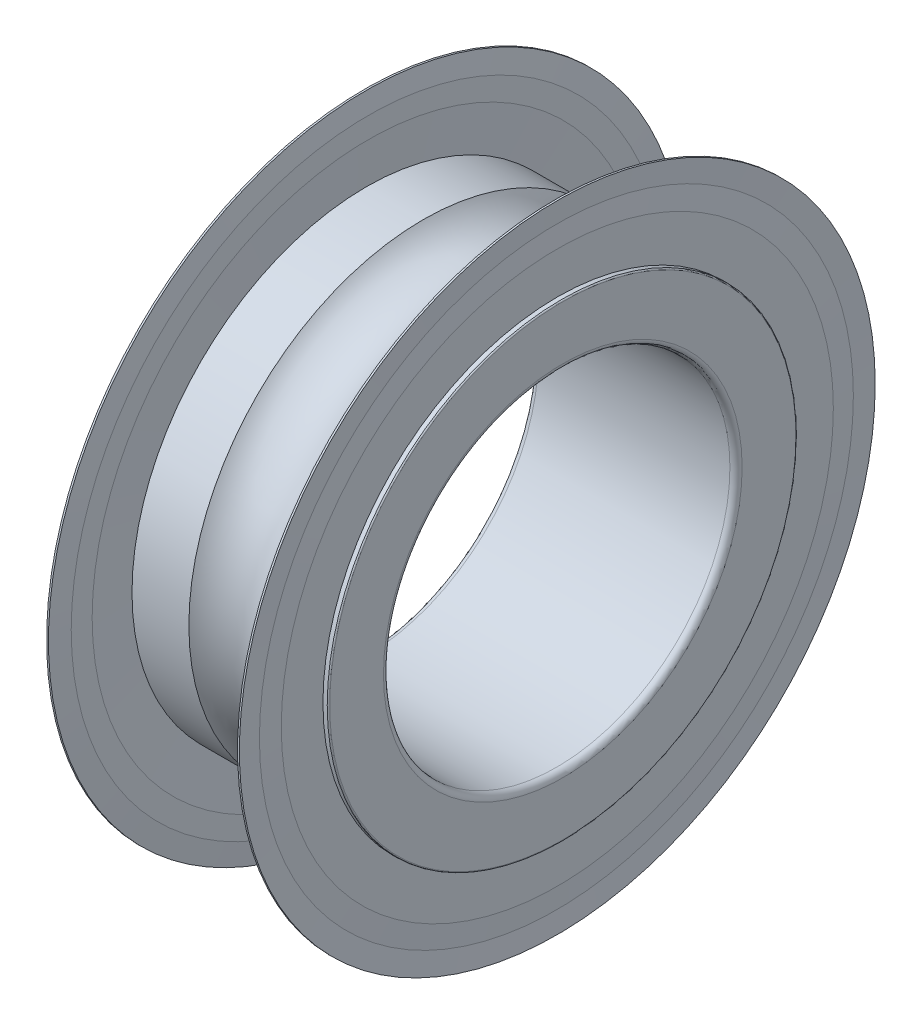
ISO-10303-21;
HEADER;
FILE_DESCRIPTION(('STEP AP214'),'2;1');
FILE_NAME('part.step','',(''),(''),'','','');
FILE_SCHEMA(('AUTOMOTIVE_DESIGN { 1 0 10303 214 1 1 1 1 }'));
ENDSEC;
DATA;
#1=APPLICATION_CONTEXT('core data for automotive mechanical design processes');
#2=APPLICATION_PROTOCOL_DEFINITION('international standard','automotive_design',2000,#1);
#3=PRODUCT_CONTEXT('',#1,'mechanical');
#4=PRODUCT('Part','Part','',(#3));
#5=PRODUCT_RELATED_PRODUCT_CATEGORY('part','',(#4));
#6=PRODUCT_DEFINITION_FORMATION('','',#4);
#7=PRODUCT_DEFINITION_CONTEXT('part definition',#1,'design');
#8=PRODUCT_DEFINITION('design','',#6,#7);
#9=PRODUCT_DEFINITION_SHAPE('','',#8);
#10=(LENGTH_UNIT() NAMED_UNIT(*) SI_UNIT(.MILLI.,.METRE.));
#11=(NAMED_UNIT(*) PLANE_ANGLE_UNIT() SI_UNIT($,.RADIAN.));
#12=(NAMED_UNIT(*) SI_UNIT($,.STERADIAN.) SOLID_ANGLE_UNIT());
#13=UNCERTAINTY_MEASURE_WITH_UNIT(LENGTH_MEASURE(1.E-05),#10,'distance_accuracy_value','');
#14=(GEOMETRIC_REPRESENTATION_CONTEXT(3) GLOBAL_UNCERTAINTY_ASSIGNED_CONTEXT((#13)) GLOBAL_UNIT_ASSIGNED_CONTEXT((#10,
#11,#12)) REPRESENTATION_CONTEXT('',''));
#15=CARTESIAN_POINT('',(0.,0.,0.));
#16=DIRECTION('',(0.,0.,1.));
#17=DIRECTION('',(1.,0.,0.));
#18=AXIS2_PLACEMENT_3D('',#15,#16,#17);
#19=CARTESIAN_POINT('',(50.,0.,0.));
#20=DIRECTION('',(1.,0.,0.));
#21=DIRECTION('',(0.,0.,-1.));
#22=AXIS2_PLACEMENT_3D('',#19,#20,#21);
#23=CYLINDRICAL_SURFACE('',#22,15.6);
#24=CARTESIAN_POINT('',(9.73,0.,0.));
#25=DIRECTION('',(1.,0.,0.));
#26=DIRECTION('',(0.,0.,-1.));
#27=AXIS2_PLACEMENT_3D('',#24,#25,#26);
#28=CIRCLE('',#27,15.6);
#29=CARTESIAN_POINT('',(9.73,0.,-15.6));
#30=VERTEX_POINT('',#29);
#31=EDGE_CURVE('E11',#30,#30,#28,.T.);
#32=ORIENTED_EDGE('',*,*,#31,.F.);
#33=EDGE_LOOP('',(#32));
#34=FACE_BOUND('',#33,.T.);
#35=CARTESIAN_POINT('',(9.64,0.,0.));
#36=DIRECTION('',(1.,0.,0.));
#37=DIRECTION('',(0.,0.,-1.));
#38=AXIS2_PLACEMENT_3D('',#35,#36,#37);
#39=CIRCLE('',#38,15.6);
#40=CARTESIAN_POINT('',(9.64,0.,-15.6));
#41=VERTEX_POINT('',#40);
#42=EDGE_CURVE('E291',#41,#41,#39,.T.);
#43=ORIENTED_EDGE('',*,*,#42,.T.);
#44=EDGE_LOOP('',(#43));
#45=FACE_BOUND('',#44,.T.);
#46=ADVANCED_FACE('F16',(#34,#45),#23,.T.);
#47=CARTESIAN_POINT('',(9.685,0.,0.));
#48=DIRECTION('',(1.,0.,0.));
#49=DIRECTION('',(0.,0.,-1.));
#50=AXIS2_PLACEMENT_3D('',#47,#48,#49);
#51=CONICAL_SURFACE('',#50,14.5725,1.52702867499964);
#52=CARTESIAN_POINT('',(9.685,0.,0.));
#53=DIRECTION('',(1.,0.,0.));
#54=DIRECTION('',(0.,0.,-1.));
#55=AXIS2_PLACEMENT_3D('',#52,#53,#54);
#56=CIRCLE('',#55,14.5725);
#57=CARTESIAN_POINT('',(9.685,0.,-14.5725));
#58=VERTEX_POINT('',#57);
#59=EDGE_CURVE('E26',#58,#58,#56,.T.);
#60=ORIENTED_EDGE('',*,*,#59,.F.);
#61=EDGE_LOOP('',(#60));
#62=FACE_BOUND('',#61,.T.);
#63=ORIENTED_EDGE('',*,*,#31,.T.);
#64=EDGE_LOOP('',(#63));
#65=FACE_BOUND('',#64,.T.);
#66=ADVANCED_FACE('F193',(#62,#65),#51,.F.);
#67=CARTESIAN_POINT('',(9.73,0.,0.));
#68=DIRECTION('',(-1.,0.,0.));
#69=DIRECTION('',(0.,0.,1.));
#70=AXIS2_PLACEMENT_3D('',#67,#68,#69);
#71=CONICAL_SURFACE('',#70,13.545,1.52702867499964);
#72=CARTESIAN_POINT('',(9.73,0.,0.));
#73=DIRECTION('',(1.,0.,0.));
#74=DIRECTION('',(0.,0.,-1.));
#75=AXIS2_PLACEMENT_3D('',#72,#73,#74);
#76=CIRCLE('',#75,13.545);
#77=CARTESIAN_POINT('',(9.73,0.,-13.545));
#78=VERTEX_POINT('',#77);
#79=EDGE_CURVE('E163',#78,#78,#76,.T.);
#80=ORIENTED_EDGE('',*,*,#79,.F.);
#81=EDGE_LOOP('',(#80));
#82=FACE_BOUND('',#81,.T.);
#83=ORIENTED_EDGE('',*,*,#59,.T.);
#84=EDGE_LOOP('',(#83));
#85=FACE_BOUND('',#84,.T.);
#86=ADVANCED_FACE('F198',(#82,#85),#71,.T.);
#87=CARTESIAN_POINT('',(9.73,11.49,0.));
#88=DIRECTION('',(1.,0.,0.));
#89=DIRECTION('',(0.,1.,0.));
#90=AXIS2_PLACEMENT_3D('',#87,#88,#89);
#91=PLANE('',#90);
#92=CARTESIAN_POINT('',(9.73,0.,0.));
#93=DIRECTION('',(-1.,0.,0.));
#94=DIRECTION('',(0.,0.,-1.));
#95=AXIS2_PLACEMENT_3D('',#92,#93,#94);
#96=CIRCLE('',#95,11.5);
#97=CARTESIAN_POINT('',(9.73,0.,-11.5));
#98=VERTEX_POINT('',#97);
#99=EDGE_CURVE('E158',#98,#98,#96,.T.);
#100=ORIENTED_EDGE('',*,*,#99,.T.);
#101=EDGE_LOOP('',(#100));
#102=FACE_BOUND('',#101,.T.);
#103=ORIENTED_EDGE('',*,*,#79,.T.);
#104=EDGE_LOOP('',(#103));
#105=FACE_BOUND('',#104,.T.);
#106=ADVANCED_FACE('F221',(#102,#105),#91,.T.);
#107=CARTESIAN_POINT('',(9.55,0.,0.));
#108=DIRECTION('',(-1.,0.,0.));
#109=DIRECTION('',(0.,0.,1.));
#110=AXIS2_PLACEMENT_3D('',#107,#108,#109);
#111=CONICAL_SURFACE('',#110,13.545,1.52702867499964);
#112=CARTESIAN_POINT('',(9.55,0.,0.));
#113=DIRECTION('',(1.,0.,0.));
#114=DIRECTION('',(0.,0.,-1.));
#115=AXIS2_PLACEMENT_3D('',#112,#113,#114);
#116=CIRCLE('',#115,13.545);
#117=CARTESIAN_POINT('',(9.55,0.,-13.545));
#118=VERTEX_POINT('',#117);
#119=EDGE_CURVE('E165',#118,#118,#116,.T.);
#120=ORIENTED_EDGE('',*,*,#119,.F.);
#121=EDGE_LOOP('',(#120));
#122=FACE_BOUND('',#121,.T.);
#123=CARTESIAN_POINT('',(9.63956204379562,0.,0.));
#124=DIRECTION('',(1.,0.,0.));
#125=DIRECTION('',(0.,0.,1.));
#126=AXIS2_PLACEMENT_3D('',#123,#124,#125);
#127=CIRCLE('',#126,11.5);
#128=CARTESIAN_POINT('',(9.63956204379562,0.,11.5));
#129=VERTEX_POINT('',#128);
#130=EDGE_CURVE('E139',#129,#129,#127,.T.);
#131=ORIENTED_EDGE('',*,*,#130,.T.);
#132=EDGE_LOOP('',(#131));
#133=FACE_BOUND('',#132,.T.);
#134=ADVANCED_FACE('F225',(#122,#133),#111,.F.);
#135=CARTESIAN_POINT('',(9.55,14.5725,0.));
#136=DIRECTION('',(-1.,0.,0.));
#137=DIRECTION('',(0.,0.,1.));
#138=AXIS2_PLACEMENT_3D('',#135,#136,#137);
#139=PLANE('',#138);
#140=CARTESIAN_POINT('',(9.55,0.,0.));
#141=DIRECTION('',(1.,0.,0.));
#142=DIRECTION('',(0.,0.,-1.));
#143=AXIS2_PLACEMENT_3D('',#140,#141,#142);
#144=CIRCLE('',#143,14.5725);
#145=CARTESIAN_POINT('',(9.55,0.,-14.5725));
#146=VERTEX_POINT('',#145);
#147=EDGE_CURVE('E293',#146,#146,#144,.T.);
#148=ORIENTED_EDGE('',*,*,#147,.F.);
#149=EDGE_LOOP('',(#148));
#150=FACE_BOUND('',#149,.T.);
#151=ORIENTED_EDGE('',*,*,#119,.T.);
#152=EDGE_LOOP('',(#151));
#153=FACE_BOUND('',#152,.T.);
#154=ADVANCED_FACE('F234',(#150,#153),#139,.T.);
#155=CARTESIAN_POINT('',(9.64,0.,0.));
#156=DIRECTION('',(1.,0.,0.));
#157=DIRECTION('',(0.,0.,-1.));
#158=AXIS2_PLACEMENT_3D('',#155,#156,#157);
#159=CONICAL_SURFACE('',#158,15.6,1.48342806694239);
#160=ORIENTED_EDGE('',*,*,#42,.F.);
#161=EDGE_LOOP('',(#160));
#162=FACE_BOUND('',#161,.T.);
#163=ORIENTED_EDGE('',*,*,#147,.T.);
#164=EDGE_LOOP('',(#163));
#165=FACE_BOUND('',#164,.T.);
#166=ADVANCED_FACE('F253',(#162,#165),#159,.T.);
#167=CARTESIAN_POINT('',(0.45,0.,0.));
#168=DIRECTION('',(-1.,0.,0.));
#169=DIRECTION('',(0.,0.,1.));
#170=AXIS2_PLACEMENT_3D('',#167,#168,#169);
#171=CONICAL_SURFACE('',#170,14.5725,1.48342806694239);
#172=CARTESIAN_POINT('',(0.45,0.,0.));
#173=DIRECTION('',(1.,0.,0.));
#174=DIRECTION('',(0.,0.,-1.));
#175=AXIS2_PLACEMENT_3D('',#172,#173,#174);
#176=CIRCLE('',#175,14.5725);
#177=CARTESIAN_POINT('',(0.45,0.,-14.5725));
#178=VERTEX_POINT('',#177);
#179=EDGE_CURVE('E262',#178,#178,#176,.T.);
#180=ORIENTED_EDGE('',*,*,#179,.F.);
#181=EDGE_LOOP('',(#180));
#182=FACE_BOUND('',#181,.T.);
#183=CARTESIAN_POINT('',(0.36,0.,0.));
#184=DIRECTION('',(1.,0.,0.));
#185=DIRECTION('',(0.,0.,-1.));
#186=AXIS2_PLACEMENT_3D('',#183,#184,#185);
#187=CIRCLE('',#186,15.6);
#188=CARTESIAN_POINT('',(0.36,0.,-15.6));
#189=VERTEX_POINT('',#188);
#190=EDGE_CURVE('E264',#189,#189,#187,.T.);
#191=ORIENTED_EDGE('',*,*,#190,.T.);
#192=EDGE_LOOP('',(#191));
#193=FACE_BOUND('',#192,.T.);
#194=ADVANCED_FACE('F239',(#182,#193),#171,.T.);
#195=CARTESIAN_POINT('',(0.45,13.545,0.));
#196=DIRECTION('',(1.,0.,0.));
#197=DIRECTION('',(0.,1.,0.));
#198=AXIS2_PLACEMENT_3D('',#195,#196,#197);
#199=PLANE('',#198);
#200=CARTESIAN_POINT('',(0.45,0.,0.));
#201=DIRECTION('',(1.,0.,0.));
#202=DIRECTION('',(0.,0.,-1.));
#203=AXIS2_PLACEMENT_3D('',#200,#201,#202);
#204=CIRCLE('',#203,13.545);
#205=CARTESIAN_POINT('',(0.45,0.,-13.545));
#206=VERTEX_POINT('',#205);
#207=EDGE_CURVE('E283',#206,#206,#204,.T.);
#208=ORIENTED_EDGE('',*,*,#207,.F.);
#209=EDGE_LOOP('',(#208));
#210=FACE_BOUND('',#209,.T.);
#211=ORIENTED_EDGE('',*,*,#179,.T.);
#212=EDGE_LOOP('',(#211));
#213=FACE_BOUND('',#212,.T.);
#214=ADVANCED_FACE('F236',(#210,#213),#199,.T.);
#215=CARTESIAN_POINT('',(0.36,0.,0.));
#216=DIRECTION('',(1.,0.,0.));
#217=DIRECTION('',(0.,0.,-1.));
#218=AXIS2_PLACEMENT_3D('',#215,#216,#217);
#219=CONICAL_SURFACE('',#218,11.49,1.52702867499964);
#220=CARTESIAN_POINT('',(0.360437956204379,0.,0.));
#221=DIRECTION('',(-1.,0.,0.));
#222=DIRECTION('',(0.,0.,-1.));
#223=AXIS2_PLACEMENT_3D('',#220,#221,#222);
#224=CIRCLE('',#223,11.5);
#225=CARTESIAN_POINT('',(0.360437956204379,0.,-11.5));
#226=VERTEX_POINT('',#225);
#227=EDGE_CURVE('E276',#226,#226,#224,.T.);
#228=ORIENTED_EDGE('',*,*,#227,.T.);
#229=EDGE_LOOP('',(#228));
#230=FACE_BOUND('',#229,.T.);
#231=ORIENTED_EDGE('',*,*,#207,.T.);
#232=EDGE_LOOP('',(#231));
#233=FACE_BOUND('',#232,.T.);
#234=ADVANCED_FACE('F18',(#230,#233),#219,.F.);
#235=CARTESIAN_POINT('',(0.27,13.545,0.));
#236=DIRECTION('',(-1.,0.,0.));
#237=DIRECTION('',(0.,0.,1.));
#238=AXIS2_PLACEMENT_3D('',#235,#236,#237);
#239=PLANE('',#238);
#240=CARTESIAN_POINT('',(0.27,0.,0.));
#241=DIRECTION('',(1.,0.,0.));
#242=DIRECTION('',(0.,0.,-1.));
#243=AXIS2_PLACEMENT_3D('',#240,#241,#242);
#244=CIRCLE('',#243,13.545);
#245=CARTESIAN_POINT('',(0.27,0.,-13.545));
#246=VERTEX_POINT('',#245);
#247=EDGE_CURVE('E274',#246,#246,#244,.T.);
#248=ORIENTED_EDGE('',*,*,#247,.F.);
#249=EDGE_LOOP('',(#248));
#250=FACE_BOUND('',#249,.T.);
#251=CARTESIAN_POINT('',(0.27,0.,0.));
#252=DIRECTION('',(1.,0.,0.));
#253=DIRECTION('',(0.,0.,1.));
#254=AXIS2_PLACEMENT_3D('',#251,#252,#253);
#255=CIRCLE('',#254,11.5);
#256=CARTESIAN_POINT('',(0.27,0.,11.5));
#257=VERTEX_POINT('',#256);
#258=EDGE_CURVE('E138',#257,#257,#255,.T.);
#259=ORIENTED_EDGE('',*,*,#258,.T.);
#260=EDGE_LOOP('',(#259));
#261=FACE_BOUND('',#260,.T.);
#262=ADVANCED_FACE('F207',(#250,#261),#239,.T.);
#263=CARTESIAN_POINT('',(0.315,0.,0.));
#264=DIRECTION('',(1.,0.,0.));
#265=DIRECTION('',(0.,0.,-1.));
#266=AXIS2_PLACEMENT_3D('',#263,#264,#265);
#267=CONICAL_SURFACE('',#266,14.5725,1.52702867499964);
#268=CARTESIAN_POINT('',(0.315,0.,0.));
#269=DIRECTION('',(1.,0.,0.));
#270=DIRECTION('',(0.,0.,-1.));
#271=AXIS2_PLACEMENT_3D('',#268,#269,#270);
#272=CIRCLE('',#271,14.5725);
#273=CARTESIAN_POINT('',(0.315,0.,-14.5725));
#274=VERTEX_POINT('',#273);
#275=EDGE_CURVE('E267',#274,#274,#272,.T.);
#276=ORIENTED_EDGE('',*,*,#275,.F.);
#277=EDGE_LOOP('',(#276));
#278=FACE_BOUND('',#277,.T.);
#279=ORIENTED_EDGE('',*,*,#247,.T.);
#280=EDGE_LOOP('',(#279));
#281=FACE_BOUND('',#280,.T.);
#282=ADVANCED_FACE('F203',(#278,#281),#267,.T.);
#283=CARTESIAN_POINT('',(0.27,0.,0.));
#284=DIRECTION('',(-1.,0.,0.));
#285=DIRECTION('',(0.,0.,1.));
#286=AXIS2_PLACEMENT_3D('',#283,#284,#285);
#287=CONICAL_SURFACE('',#286,15.6,1.52702867499964);
#288=CARTESIAN_POINT('',(0.27,0.,0.));
#289=DIRECTION('',(1.,0.,0.));
#290=DIRECTION('',(0.,0.,-1.));
#291=AXIS2_PLACEMENT_3D('',#288,#289,#290);
#292=CIRCLE('',#291,15.6);
#293=CARTESIAN_POINT('',(0.27,0.,-15.6));
#294=VERTEX_POINT('',#293);
#295=EDGE_CURVE('E268',#294,#294,#292,.T.);
#296=ORIENTED_EDGE('',*,*,#295,.F.);
#297=EDGE_LOOP('',(#296));
#298=FACE_BOUND('',#297,.T.);
#299=ORIENTED_EDGE('',*,*,#275,.T.);
#300=EDGE_LOOP('',(#299));
#301=FACE_BOUND('',#300,.T.);
#302=ADVANCED_FACE('F206',(#298,#301),#287,.F.);
#303=CARTESIAN_POINT('',(50.,0.,0.));
#304=DIRECTION('',(1.,0.,0.));
#305=DIRECTION('',(0.,0.,-1.));
#306=AXIS2_PLACEMENT_3D('',#303,#304,#305);
#307=CYLINDRICAL_SURFACE('',#306,15.6);
#308=ORIENTED_EDGE('',*,*,#190,.F.);
#309=EDGE_LOOP('',(#308));
#310=FACE_BOUND('',#309,.T.);
#311=ORIENTED_EDGE('',*,*,#295,.T.);
#312=EDGE_LOOP('',(#311));
#313=FACE_BOUND('',#312,.T.);
#314=ADVANCED_FACE('F187',(#310,#313),#307,.T.);
#315=CARTESIAN_POINT('',(50.,0.,0.));
#316=DIRECTION('',(1.,0.,0.));
#317=DIRECTION('',(0.,0.,-1.));
#318=AXIS2_PLACEMENT_3D('',#315,#316,#317);
#319=CYLINDRICAL_SURFACE('',#318,11.5);
#320=CARTESIAN_POINT('',(3.15090265264373,0.,0.));
#321=DIRECTION('',(1.,0.,0.));
#322=DIRECTION('',(0.,0.,-1.));
#323=AXIS2_PLACEMENT_3D('',#320,#321,#322);
#324=CIRCLE('',#323,11.5);
#325=CARTESIAN_POINT('',(3.15090265264373,0.,-11.5));
#326=VERTEX_POINT('',#325);
#327=EDGE_CURVE('E161',#326,#326,#324,.T.);
#328=ORIENTED_EDGE('',*,*,#327,.F.);
#329=EDGE_LOOP('',(#328));
#330=FACE_BOUND('',#329,.T.);
#331=ORIENTED_EDGE('',*,*,#227,.F.);
#332=EDGE_LOOP('',(#331));
#333=FACE_BOUND('',#332,.T.);
#334=ADVANCED_FACE('F176',(#330,#333),#319,.T.);
#335=CARTESIAN_POINT('',(5.,0.,0.));
#336=DIRECTION('',(1.,0.,0.));
#337=DIRECTION('',(0.,0.,-1.));
#338=AXIS2_PLACEMENT_3D('',#335,#336,#337);
#339=TOROIDAL_SURFACE('',#338,13.,2.381);
#340=ORIENTED_EDGE('',*,*,#327,.T.);
#341=EDGE_LOOP('',(#340));
#342=FACE_BOUND('',#341,.T.);
#343=CARTESIAN_POINT('',(6.84909734735627,0.,0.));
#344=DIRECTION('',(1.,0.,0.));
#345=DIRECTION('',(0.,0.,-1.));
#346=AXIS2_PLACEMENT_3D('',#343,#344,#345);
#347=CIRCLE('',#346,11.5);
#348=CARTESIAN_POINT('',(6.84909734735627,0.,-11.5));
#349=VERTEX_POINT('',#348);
#350=EDGE_CURVE('E148',#349,#349,#347,.T.);
#351=ORIENTED_EDGE('',*,*,#350,.F.);
#352=EDGE_LOOP('',(#351));
#353=FACE_BOUND('',#352,.T.);
#354=ADVANCED_FACE('F173',(#342,#353),#339,.F.);
#355=CARTESIAN_POINT('',(50.,0.,0.));
#356=DIRECTION('',(1.,0.,0.));
#357=DIRECTION('',(0.,0.,-1.));
#358=AXIS2_PLACEMENT_3D('',#355,#356,#357);
#359=CYLINDRICAL_SURFACE('',#358,11.5);
#360=CARTESIAN_POINT('',(9.94,0.,0.));
#361=DIRECTION('',(1.,0.,0.));
#362=DIRECTION('',(0.,0.,-1.));
#363=AXIS2_PLACEMENT_3D('',#360,#361,#362);
#364=CIRCLE('',#363,11.5);
#365=CARTESIAN_POINT('',(9.94,0.,-11.5));
#366=VERTEX_POINT('',#365);
#367=EDGE_CURVE('E162',#366,#366,#364,.T.);
#368=ORIENTED_EDGE('',*,*,#367,.F.);
#369=EDGE_LOOP('',(#368));
#370=FACE_BOUND('',#369,.T.);
#371=ORIENTED_EDGE('',*,*,#99,.F.);
#372=EDGE_LOOP('',(#371));
#373=FACE_BOUND('',#372,.T.);
#374=ADVANCED_FACE('F175',(#370,#373),#359,.T.);
#375=CARTESIAN_POINT('',(9.94,0.,0.));
#376=DIRECTION('',(1.,0.,0.));
#377=DIRECTION('',(0.,0.,-1.));
#378=AXIS2_PLACEMENT_3D('',#375,#376,#377);
#379=TOROIDAL_SURFACE('',#378,11.44,0.0599999999999976);
#380=CARTESIAN_POINT('',(10.,0.,0.));
#381=DIRECTION('',(1.,0.,0.));
#382=DIRECTION('',(0.,0.,-1.));
#383=AXIS2_PLACEMENT_3D('',#380,#381,#382);
#384=CIRCLE('',#383,11.44);
#385=CARTESIAN_POINT('',(10.,0.,-11.44));
#386=VERTEX_POINT('',#385);
#387=EDGE_CURVE('E152',#386,#386,#384,.T.);
#388=ORIENTED_EDGE('',*,*,#387,.F.);
#389=EDGE_LOOP('',(#388));
#390=FACE_BOUND('',#389,.T.);
#391=ORIENTED_EDGE('',*,*,#367,.T.);
#392=EDGE_LOOP('',(#391));
#393=FACE_BOUND('',#392,.T.);
#394=ADVANCED_FACE('F184',(#390,#393),#379,.T.);
#395=CARTESIAN_POINT('',(10.,8.8,0.));
#396=DIRECTION('',(1.,0.,0.));
#397=DIRECTION('',(0.,1.,0.));
#398=AXIS2_PLACEMENT_3D('',#395,#396,#397);
#399=PLANE('',#398);
#400=CARTESIAN_POINT('',(10.,0.,0.));
#401=DIRECTION('',(1.,0.,0.));
#402=DIRECTION('',(0.,0.,-1.));
#403=AXIS2_PLACEMENT_3D('',#400,#401,#402);
#404=CIRCLE('',#403,8.8);
#405=CARTESIAN_POINT('',(10.,0.,-8.8));
#406=VERTEX_POINT('',#405);
#407=EDGE_CURVE('E286',#406,#406,#404,.T.);
#408=ORIENTED_EDGE('',*,*,#407,.F.);
#409=EDGE_LOOP('',(#408));
#410=FACE_BOUND('',#409,.T.);
#411=ORIENTED_EDGE('',*,*,#387,.T.);
#412=EDGE_LOOP('',(#411));
#413=FACE_BOUND('',#412,.T.);
#414=ADVANCED_FACE('F215',(#410,#413),#399,.T.);
#415=CARTESIAN_POINT('',(9.7,0.,0.));
#416=DIRECTION('',(1.,0.,0.));
#417=DIRECTION('',(0.,0.,-1.));
#418=AXIS2_PLACEMENT_3D('',#415,#416,#417);
#419=TOROIDAL_SURFACE('',#418,8.8,0.300000000000005);
#420=CARTESIAN_POINT('',(9.7,0.,0.));
#421=DIRECTION('',(1.,0.,0.));
#422=DIRECTION('',(0.,0.,-1.));
#423=AXIS2_PLACEMENT_3D('',#420,#421,#422);
#424=CIRCLE('',#423,8.5);
#425=CARTESIAN_POINT('',(9.7,0.,-8.5));
#426=VERTEX_POINT('',#425);
#427=EDGE_CURVE('E284',#426,#426,#424,.T.);
#428=ORIENTED_EDGE('',*,*,#427,.F.);
#429=EDGE_LOOP('',(#428));
#430=FACE_BOUND('',#429,.T.);
#431=ORIENTED_EDGE('',*,*,#407,.T.);
#432=EDGE_LOOP('',(#431));
#433=FACE_BOUND('',#432,.T.);
#434=ADVANCED_FACE('F213',(#430,#433),#419,.T.);
#435=CARTESIAN_POINT('',(50.,0.,0.));
#436=DIRECTION('',(1.,0.,0.));
#437=DIRECTION('',(0.,0.,-1.));
#438=AXIS2_PLACEMENT_3D('',#435,#436,#437);
#439=CYLINDRICAL_SURFACE('',#438,8.5);
#440=CARTESIAN_POINT('',(0.3,0.,0.));
#441=DIRECTION('',(1.,0.,0.));
#442=DIRECTION('',(0.,0.,-1.));
#443=AXIS2_PLACEMENT_3D('',#440,#441,#442);
#444=CIRCLE('',#443,8.5);
#445=CARTESIAN_POINT('',(0.3,0.,-8.5));
#446=VERTEX_POINT('',#445);
#447=EDGE_CURVE('E157',#446,#446,#444,.T.);
#448=ORIENTED_EDGE('',*,*,#447,.F.);
#449=EDGE_LOOP('',(#448));
#450=FACE_BOUND('',#449,.T.);
#451=ORIENTED_EDGE('',*,*,#427,.T.);
#452=EDGE_LOOP('',(#451));
#453=FACE_BOUND('',#452,.T.);
#454=ADVANCED_FACE('F209',(#450,#453),#439,.F.);
#455=CARTESIAN_POINT('',(0.3,0.,0.));
#456=DIRECTION('',(1.,0.,0.));
#457=DIRECTION('',(0.,0.,-1.));
#458=AXIS2_PLACEMENT_3D('',#455,#456,#457);
#459=TOROIDAL_SURFACE('',#458,8.8,0.3);
#460=CARTESIAN_POINT('',(0.,0.,0.));
#461=DIRECTION('',(1.,0.,0.));
#462=DIRECTION('',(0.,0.,-1.));
#463=AXIS2_PLACEMENT_3D('',#460,#461,#462);
#464=CIRCLE('',#463,8.8);
#465=CARTESIAN_POINT('',(0.,0.,-8.8));
#466=VERTEX_POINT('',#465);
#467=EDGE_CURVE('E154',#466,#466,#464,.T.);
#468=ORIENTED_EDGE('',*,*,#467,.F.);
#469=EDGE_LOOP('',(#468));
#470=FACE_BOUND('',#469,.T.);
#471=ORIENTED_EDGE('',*,*,#447,.T.);
#472=EDGE_LOOP('',(#471));
#473=FACE_BOUND('',#472,.T.);
#474=ADVANCED_FACE('F212',(#470,#473),#459,.T.);
#475=CARTESIAN_POINT('',(0.,11.44,0.));
#476=DIRECTION('',(-1.,0.,0.));
#477=DIRECTION('',(0.,0.,1.));
#478=AXIS2_PLACEMENT_3D('',#475,#476,#477);
#479=PLANE('',#478);
#480=CARTESIAN_POINT('',(0.,0.,0.));
#481=DIRECTION('',(1.,0.,0.));
#482=DIRECTION('',(0.,0.,-1.));
#483=AXIS2_PLACEMENT_3D('',#480,#481,#482);
#484=CIRCLE('',#483,11.44);
#485=CARTESIAN_POINT('',(0.,0.,-11.44));
#486=VERTEX_POINT('',#485);
#487=EDGE_CURVE('E146',#486,#486,#484,.T.);
#488=ORIENTED_EDGE('',*,*,#487,.F.);
#489=EDGE_LOOP('',(#488));
#490=FACE_BOUND('',#489,.T.);
#491=ORIENTED_EDGE('',*,*,#467,.T.);
#492=EDGE_LOOP('',(#491));
#493=FACE_BOUND('',#492,.T.);
#494=ADVANCED_FACE('F227',(#490,#493),#479,.T.);
#495=CARTESIAN_POINT('',(0.0599999999999987,0.,0.));
#496=DIRECTION('',(1.,0.,0.));
#497=DIRECTION('',(0.,0.,-1.));
#498=AXIS2_PLACEMENT_3D('',#495,#496,#497);
#499=TOROIDAL_SURFACE('',#498,11.44,0.0599999999999993);
#500=CARTESIAN_POINT('',(0.0599999999999976,0.,0.));
#501=DIRECTION('',(1.,0.,0.));
#502=DIRECTION('',(0.,0.,-1.));
#503=AXIS2_PLACEMENT_3D('',#500,#501,#502);
#504=CIRCLE('',#503,11.5);
#505=CARTESIAN_POINT('',(0.0599999999999976,0.,-11.5));
#506=VERTEX_POINT('',#505);
#507=EDGE_CURVE('E134',#506,#506,#504,.T.);
#508=ORIENTED_EDGE('',*,*,#507,.F.);
#509=EDGE_LOOP('',(#508));
#510=FACE_BOUND('',#509,.T.);
#511=ORIENTED_EDGE('',*,*,#487,.T.);
#512=EDGE_LOOP('',(#511));
#513=FACE_BOUND('',#512,.T.);
#514=ADVANCED_FACE('F230',(#510,#513),#499,.T.);
#515=CARTESIAN_POINT('',(50.,0.,0.));
#516=DIRECTION('',(1.,0.,0.));
#517=DIRECTION('',(0.,0.,-1.));
#518=AXIS2_PLACEMENT_3D('',#515,#516,#517);
#519=CYLINDRICAL_SURFACE('',#518,11.5);
#520=ORIENTED_EDGE('',*,*,#258,.F.);
#521=EDGE_LOOP('',(#520));
#522=FACE_BOUND('',#521,.T.);
#523=ORIENTED_EDGE('',*,*,#507,.T.);
#524=EDGE_LOOP('',(#523));
#525=FACE_BOUND('',#524,.T.);
#526=ADVANCED_FACE('F135',(#522,#525),#519,.T.);
#527=CARTESIAN_POINT('',(50.,0.,0.));
#528=DIRECTION('',(1.,0.,0.));
#529=DIRECTION('',(0.,0.,-1.));
#530=AXIS2_PLACEMENT_3D('',#527,#528,#529);
#531=CYLINDRICAL_SURFACE('',#530,11.5);
#532=ORIENTED_EDGE('',*,*,#130,.F.);
#533=EDGE_LOOP('',(#532));
#534=FACE_BOUND('',#533,.T.);
#535=ORIENTED_EDGE('',*,*,#350,.T.);
#536=EDGE_LOOP('',(#535));
#537=FACE_BOUND('',#536,.T.);
#538=ADVANCED_FACE('F171',(#534,#537),#531,.T.);
#539=CLOSED_SHELL('',(#46,#66,#86,#106,#134,#154,#166,#194,#214,#234,#262,#282,#302,#314,#334,
#354,#374,#394,#414,#434,#454,#474,#494,#514,#526,#538));
#540=MANIFOLD_SOLID_BREP('B1',#539);
#541=ADVANCED_BREP_SHAPE_REPRESENTATION('',(#18,#540),#14);
#542=SHAPE_DEFINITION_REPRESENTATION(#9,#541);
ENDSEC;
END-ISO-10303-21;
